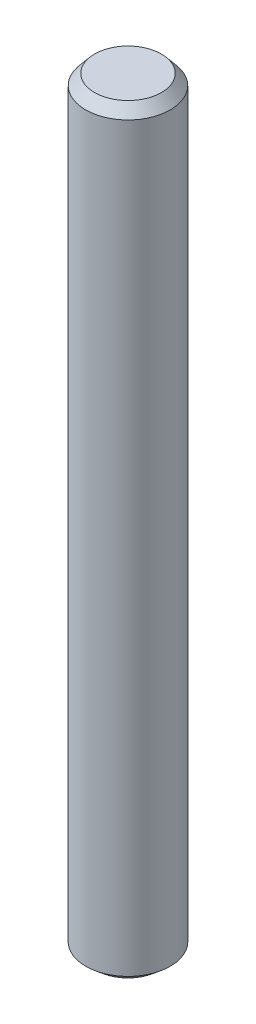
ISO-10303-21;
HEADER;
FILE_DESCRIPTION(('STEP AP214'),'2;1');
FILE_NAME('part.step','',(''),(''),'','','');
FILE_SCHEMA(('AUTOMOTIVE_DESIGN { 1 0 10303 214 1 1 1 1 }'));
ENDSEC;
DATA;
#1=APPLICATION_CONTEXT('core data for automotive mechanical design processes');
#2=APPLICATION_PROTOCOL_DEFINITION('international standard','automotive_design',2000,#1);
#3=PRODUCT_CONTEXT('',#1,'mechanical');
#4=PRODUCT('Part','Part','',(#3));
#5=PRODUCT_RELATED_PRODUCT_CATEGORY('part','',(#4));
#6=PRODUCT_DEFINITION_FORMATION('','',#4);
#7=PRODUCT_DEFINITION_CONTEXT('part definition',#1,'design');
#8=PRODUCT_DEFINITION('design','',#6,#7);
#9=PRODUCT_DEFINITION_SHAPE('','',#8);
#10=(LENGTH_UNIT() NAMED_UNIT(*) SI_UNIT(.MILLI.,.METRE.));
#11=(NAMED_UNIT(*) PLANE_ANGLE_UNIT() SI_UNIT($,.RADIAN.));
#12=(NAMED_UNIT(*) SI_UNIT($,.STERADIAN.) SOLID_ANGLE_UNIT());
#13=UNCERTAINTY_MEASURE_WITH_UNIT(LENGTH_MEASURE(1.E-05),#10,'distance_accuracy_value','');
#14=(GEOMETRIC_REPRESENTATION_CONTEXT(3) GLOBAL_UNCERTAINTY_ASSIGNED_CONTEXT((#13)) GLOBAL_UNIT_ASSIGNED_CONTEXT((#10,
#11,#12)) REPRESENTATION_CONTEXT('',''));
#15=CARTESIAN_POINT('',(0.,0.,0.));
#16=DIRECTION('',(0.,0.,1.));
#17=DIRECTION('',(1.,0.,0.));
#18=AXIS2_PLACEMENT_3D('',#15,#16,#17);
#19=CARTESIAN_POINT('',(0.,72.,0.));
#20=DIRECTION('',(0.,-1.,0.));
#21=DIRECTION('',(0.,0.,-1.));
#22=AXIS2_PLACEMENT_3D('',#19,#20,#21);
#23=CYLINDRICAL_SURFACE('',#22,4.);
#24=CARTESIAN_POINT('',(0.,0.839099631177273,0.));
#25=DIRECTION('',(0.,1.,0.));
#26=DIRECTION('',(0.,0.,1.));
#27=AXIS2_PLACEMENT_3D('',#24,#25,#26);
#28=CIRCLE('',#27,4.);
#29=CARTESIAN_POINT('',(0.,0.839099631177273,4.));
#30=VERTEX_POINT('',#29);
#31=EDGE_CURVE('E45',#30,#30,#28,.T.);
#32=ORIENTED_EDGE('',*,*,#31,.T.);
#33=EDGE_LOOP('',(#32));
#34=FACE_BOUND('',#33,.T.);
#35=CARTESIAN_POINT('',(0.,71.,0.));
#36=DIRECTION('',(0.,1.,0.));
#37=DIRECTION('',(0.,0.,1.));
#38=AXIS2_PLACEMENT_3D('',#35,#36,#37);
#39=CIRCLE('',#38,4.);
#40=CARTESIAN_POINT('',(0.,71.,4.));
#41=VERTEX_POINT('',#40);
#42=EDGE_CURVE('E49',#41,#41,#39,.F.);
#43=ORIENTED_EDGE('',*,*,#42,.T.);
#44=EDGE_LOOP('',(#43));
#45=FACE_BOUND('',#44,.T.);
#46=ADVANCED_FACE('F34',(#34,#45),#23,.T.);
#47=CARTESIAN_POINT('',(0.,72.,0.));
#48=DIRECTION('',(0.,1.,0.));
#49=DIRECTION('',(0.,0.,1.));
#50=AXIS2_PLACEMENT_3D('',#47,#48,#49);
#51=PLANE('',#50);
#52=CARTESIAN_POINT('',(0.,72.,0.));
#53=DIRECTION('',(0.,1.,0.));
#54=DIRECTION('',(0.,0.,1.));
#55=AXIS2_PLACEMENT_3D('',#52,#53,#54);
#56=CIRCLE('',#55,3.16090036882271);
#57=CARTESIAN_POINT('',(0.,72.,3.16090036882271));
#58=VERTEX_POINT('',#57);
#59=EDGE_CURVE('E10',#58,#58,#56,.T.);
#60=ORIENTED_EDGE('',*,*,#59,.T.);
#61=EDGE_LOOP('',(#60));
#62=FACE_BOUND('',#61,.T.);
#63=ADVANCED_FACE('F65',(#62),#51,.T.);
#64=CARTESIAN_POINT('',(0.,0.,0.));
#65=DIRECTION('',(0.,1.,0.));
#66=DIRECTION('',(0.,0.,1.));
#67=AXIS2_PLACEMENT_3D('',#64,#65,#66);
#68=PLANE('',#67);
#69=CARTESIAN_POINT('',(0.,0.,0.));
#70=DIRECTION('',(0.,1.,0.));
#71=DIRECTION('',(0.,0.,1.));
#72=AXIS2_PLACEMENT_3D('',#69,#70,#71);
#73=CIRCLE('',#72,3.00000000000001);
#74=CARTESIAN_POINT('',(0.,0.,3.00000000000001));
#75=VERTEX_POINT('',#74);
#76=EDGE_CURVE('E41',#75,#75,#73,.F.);
#77=ORIENTED_EDGE('',*,*,#76,.T.);
#78=EDGE_LOOP('',(#77));
#79=FACE_BOUND('',#78,.T.);
#80=ADVANCED_FACE('F62',(#79),#68,.F.);
#81=CARTESIAN_POINT('',(0.,0.839099631177273,0.));
#82=DIRECTION('',(0.,1.,0.));
#83=DIRECTION('',(0.,0.,1.));
#84=AXIS2_PLACEMENT_3D('',#81,#82,#83);
#85=CONICAL_SURFACE('',#84,4.,0.872664625997164);
#86=ORIENTED_EDGE('',*,*,#76,.F.);
#87=EDGE_LOOP('',(#86));
#88=FACE_BOUND('',#87,.T.);
#89=ORIENTED_EDGE('',*,*,#31,.F.);
#90=EDGE_LOOP('',(#89));
#91=FACE_BOUND('',#90,.T.);
#92=ADVANCED_FACE('F58',(#88,#91),#85,.T.);
#93=CARTESIAN_POINT('',(0.,72.,0.));
#94=DIRECTION('',(0.,-1.,0.));
#95=DIRECTION('',(0.,0.,-1.));
#96=AXIS2_PLACEMENT_3D('',#93,#94,#95);
#97=CONICAL_SURFACE('',#96,3.16090036882271,0.698131700797731);
#98=ORIENTED_EDGE('',*,*,#42,.F.);
#99=EDGE_LOOP('',(#98));
#100=FACE_BOUND('',#99,.T.);
#101=ORIENTED_EDGE('',*,*,#59,.F.);
#102=EDGE_LOOP('',(#101));
#103=FACE_BOUND('',#102,.T.);
#104=ADVANCED_FACE('F36',(#100,#103),#97,.T.);
#105=CLOSED_SHELL('',(#46,#63,#80,#92,#104));
#106=MANIFOLD_SOLID_BREP('B2',#105);
#107=ADVANCED_BREP_SHAPE_REPRESENTATION('',(#18,#106),#14);
#108=SHAPE_DEFINITION_REPRESENTATION(#9,#107);
ENDSEC;
END-ISO-10303-21;
